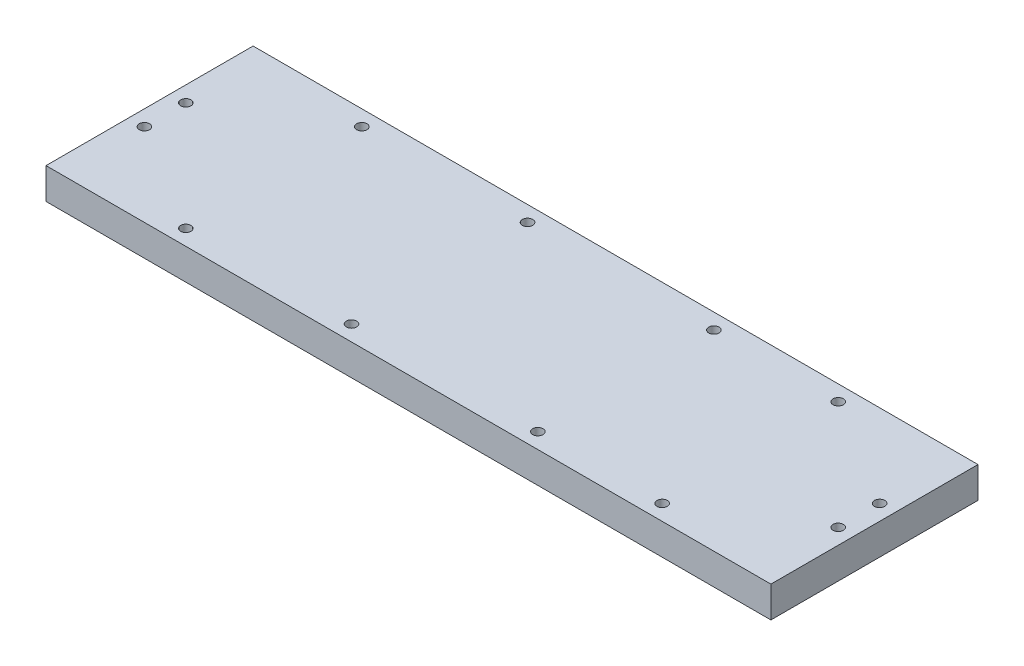
ISO-10303-21;
HEADER;
FILE_DESCRIPTION(('STEP AP214'),'2;1');
FILE_NAME('part.step','',(''),(''),'','','');
FILE_SCHEMA(('AUTOMOTIVE_DESIGN { 1 0 10303 214 1 1 1 1 }'));
ENDSEC;
DATA;
#1=APPLICATION_CONTEXT('core data for automotive mechanical design processes');
#2=APPLICATION_PROTOCOL_DEFINITION('international standard','automotive_design',2000,#1);
#3=PRODUCT_CONTEXT('',#1,'mechanical');
#4=PRODUCT('Part','Part','',(#3));
#5=PRODUCT_RELATED_PRODUCT_CATEGORY('part','',(#4));
#6=PRODUCT_DEFINITION_FORMATION('','',#4);
#7=PRODUCT_DEFINITION_CONTEXT('part definition',#1,'design');
#8=PRODUCT_DEFINITION('design','',#6,#7);
#9=PRODUCT_DEFINITION_SHAPE('','',#8);
#10=(LENGTH_UNIT() NAMED_UNIT(*) SI_UNIT(.MILLI.,.METRE.));
#11=(NAMED_UNIT(*) PLANE_ANGLE_UNIT() SI_UNIT($,.RADIAN.));
#12=(NAMED_UNIT(*) SI_UNIT($,.STERADIAN.) SOLID_ANGLE_UNIT());
#13=UNCERTAINTY_MEASURE_WITH_UNIT(LENGTH_MEASURE(1.E-05),#10,'distance_accuracy_value','');
#14=(GEOMETRIC_REPRESENTATION_CONTEXT(3) GLOBAL_UNCERTAINTY_ASSIGNED_CONTEXT((#13)) GLOBAL_UNIT_ASSIGNED_CONTEXT((#10,
#11,#12)) REPRESENTATION_CONTEXT('',''));
#15=CARTESIAN_POINT('',(0.,0.,0.));
#16=DIRECTION('',(0.,0.,1.));
#17=DIRECTION('',(1.,0.,0.));
#18=AXIS2_PLACEMENT_3D('',#15,#16,#17);
#19=CARTESIAN_POINT('',(222.25,19.05,-63.5));
#20=DIRECTION('',(-1.,0.,0.));
#21=DIRECTION('',(0.,0.,1.));
#22=AXIS2_PLACEMENT_3D('',#19,#20,#21);
#23=PLANE('',#22);
#24=DIRECTION('',(0.,0.,-1.));
#25=VECTOR('',#24,1.);
#26=CARTESIAN_POINT('',(222.25,0.,-63.5));
#27=LINE('',#26,#25);
#28=CARTESIAN_POINT('',(222.25,0.,63.5));
#29=VERTEX_POINT('',#28);
#30=CARTESIAN_POINT('',(222.25,0.,-63.5));
#31=VERTEX_POINT('',#30);
#32=EDGE_CURVE('E109',#29,#31,#27,.T.);
#33=ORIENTED_EDGE('',*,*,#32,.T.);
#34=DIRECTION('',(0.,-1.,0.));
#35=VECTOR('',#34,1.);
#36=CARTESIAN_POINT('',(222.25,19.05,-63.5));
#37=LINE('',#36,#35);
#38=CARTESIAN_POINT('',(222.25,19.05,-63.5));
#39=VERTEX_POINT('',#38);
#40=EDGE_CURVE('E11',#39,#31,#37,.T.);
#41=ORIENTED_EDGE('',*,*,#40,.F.);
#42=DIRECTION('',(0.,0.,-1.));
#43=VECTOR('',#42,1.);
#44=CARTESIAN_POINT('',(222.25,19.05,-63.5));
#45=LINE('',#44,#43);
#46=CARTESIAN_POINT('',(222.25,19.05,63.5));
#47=VERTEX_POINT('',#46);
#48=EDGE_CURVE('E92',#47,#39,#45,.T.);
#49=ORIENTED_EDGE('',*,*,#48,.F.);
#50=DIRECTION('',(0.,-1.,0.));
#51=VECTOR('',#50,1.);
#52=CARTESIAN_POINT('',(222.25,19.05,63.5));
#53=LINE('',#52,#51);
#54=EDGE_CURVE('E105',#47,#29,#53,.T.);
#55=ORIENTED_EDGE('',*,*,#54,.T.);
#56=EDGE_LOOP('',(#33,#41,#49,#55));
#57=FACE_BOUND('',#56,.T.);
#58=ADVANCED_FACE('F40',(#57),#23,.F.);
#59=CARTESIAN_POINT('',(-222.25,19.05,-63.5));
#60=DIRECTION('',(0.,0.,1.));
#61=DIRECTION('',(1.,0.,0.));
#62=AXIS2_PLACEMENT_3D('',#59,#60,#61);
#63=PLANE('',#62);
#64=DIRECTION('',(-1.,0.,0.));
#65=VECTOR('',#64,1.);
#66=CARTESIAN_POINT('',(-222.25,0.,-63.5));
#67=LINE('',#66,#65);
#68=CARTESIAN_POINT('',(-222.25,0.,-63.5));
#69=VERTEX_POINT('',#68);
#70=EDGE_CURVE('E97',#31,#69,#67,.T.);
#71=ORIENTED_EDGE('',*,*,#70,.T.);
#72=DIRECTION('',(0.,-1.,0.));
#73=VECTOR('',#72,1.);
#74=CARTESIAN_POINT('',(-222.25,19.05,-63.5));
#75=LINE('',#74,#73);
#76=CARTESIAN_POINT('',(-222.25,19.05,-63.5));
#77=VERTEX_POINT('',#76);
#78=EDGE_CURVE('E49',#77,#69,#75,.T.);
#79=ORIENTED_EDGE('',*,*,#78,.F.);
#80=DIRECTION('',(-1.,0.,0.));
#81=VECTOR('',#80,1.);
#82=CARTESIAN_POINT('',(-222.25,19.05,-63.5));
#83=LINE('',#82,#81);
#84=EDGE_CURVE('E87',#39,#77,#83,.T.);
#85=ORIENTED_EDGE('',*,*,#84,.F.);
#86=ORIENTED_EDGE('',*,*,#40,.T.);
#87=EDGE_LOOP('',(#71,#79,#85,#86));
#88=FACE_BOUND('',#87,.T.);
#89=ADVANCED_FACE('F96',(#88),#63,.F.);
#90=CARTESIAN_POINT('',(-222.25,19.05,-63.5));
#91=DIRECTION('',(1.,0.,0.));
#92=DIRECTION('',(0.,0.,-1.));
#93=AXIS2_PLACEMENT_3D('',#90,#91,#92);
#94=PLANE('',#93);
#95=DIRECTION('',(0.,0.,1.));
#96=VECTOR('',#95,1.);
#97=CARTESIAN_POINT('',(-222.25,0.,-63.5));
#98=LINE('',#97,#96);
#99=CARTESIAN_POINT('',(-222.25,0.,63.5));
#100=VERTEX_POINT('',#99);
#101=EDGE_CURVE('E74',#69,#100,#98,.T.);
#102=ORIENTED_EDGE('',*,*,#101,.T.);
#103=DIRECTION('',(0.,-1.,0.));
#104=VECTOR('',#103,1.);
#105=CARTESIAN_POINT('',(-222.25,19.05,63.5));
#106=LINE('',#105,#104);
#107=CARTESIAN_POINT('',(-222.25,19.05,63.5));
#108=VERTEX_POINT('',#107);
#109=EDGE_CURVE('E99',#108,#100,#106,.T.);
#110=ORIENTED_EDGE('',*,*,#109,.F.);
#111=DIRECTION('',(0.,0.,1.));
#112=VECTOR('',#111,1.);
#113=CARTESIAN_POINT('',(-222.25,19.05,-63.5));
#114=LINE('',#113,#112);
#115=EDGE_CURVE('E90',#77,#108,#114,.T.);
#116=ORIENTED_EDGE('',*,*,#115,.F.);
#117=ORIENTED_EDGE('',*,*,#78,.T.);
#118=EDGE_LOOP('',(#102,#110,#116,#117));
#119=FACE_BOUND('',#118,.T.);
#120=ADVANCED_FACE('F100',(#119),#94,.F.);
#121=CARTESIAN_POINT('',(-222.25,19.05,63.5));
#122=DIRECTION('',(0.,0.,-1.));
#123=DIRECTION('',(-1.,0.,0.));
#124=AXIS2_PLACEMENT_3D('',#121,#122,#123);
#125=PLANE('',#124);
#126=DIRECTION('',(1.,0.,0.));
#127=VECTOR('',#126,1.);
#128=CARTESIAN_POINT('',(-222.25,0.,63.5));
#129=LINE('',#128,#127);
#130=EDGE_CURVE('E80',#100,#29,#129,.T.);
#131=ORIENTED_EDGE('',*,*,#130,.T.);
#132=ORIENTED_EDGE('',*,*,#54,.F.);
#133=DIRECTION('',(1.,0.,0.));
#134=VECTOR('',#133,1.);
#135=CARTESIAN_POINT('',(-222.25,19.05,63.5));
#136=LINE('',#135,#134);
#137=EDGE_CURVE('E57',#108,#47,#136,.T.);
#138=ORIENTED_EDGE('',*,*,#137,.F.);
#139=ORIENTED_EDGE('',*,*,#109,.T.);
#140=EDGE_LOOP('',(#131,#132,#138,#139));
#141=FACE_BOUND('',#140,.T.);
#142=ADVANCED_FACE('F124',(#141),#125,.F.);
#143=CARTESIAN_POINT('',(0.,19.05,0.));
#144=DIRECTION('',(0.,1.,0.));
#145=DIRECTION('',(0.,0.,1.));
#146=AXIS2_PLACEMENT_3D('',#143,#144,#145);
#147=PLANE('',#146);
#148=CARTESIAN_POINT('',(212.725,19.05,-12.7));
#149=DIRECTION('',(0.,-1.,0.));
#150=DIRECTION('',(0.,0.,1.));
#151=AXIS2_PLACEMENT_3D('',#148,#149,#150);
#152=CIRCLE('',#151,3.175);
#153=CARTESIAN_POINT('',(212.725,19.05,-9.525));
#154=VERTEX_POINT('',#153);
#155=EDGE_CURVE('E221',#154,#154,#152,.T.);
#156=ORIENTED_EDGE('',*,*,#155,.T.);
#157=EDGE_LOOP('',(#156));
#158=FACE_BOUND('',#157,.T.);
#159=CARTESIAN_POINT('',(212.725,19.05,12.7));
#160=DIRECTION('',(0.,-1.,0.));
#161=DIRECTION('',(0.,0.,1.));
#162=AXIS2_PLACEMENT_3D('',#159,#160,#161);
#163=CIRCLE('',#162,3.175);
#164=CARTESIAN_POINT('',(212.725,19.05,15.875));
#165=VERTEX_POINT('',#164);
#166=EDGE_CURVE('E212',#165,#165,#163,.T.);
#167=ORIENTED_EDGE('',*,*,#166,.T.);
#168=EDGE_LOOP('',(#167));
#169=FACE_BOUND('',#168,.T.);
#170=CARTESIAN_POINT('',(-212.725,19.05,-12.7));
#171=DIRECTION('',(0.,1.,0.));
#172=DIRECTION('',(0.,0.,1.));
#173=AXIS2_PLACEMENT_3D('',#170,#171,#172);
#174=CIRCLE('',#173,3.175);
#175=CARTESIAN_POINT('',(-212.725,19.05,-9.525));
#176=VERTEX_POINT('',#175);
#177=EDGE_CURVE('E205',#176,#176,#174,.T.);
#178=ORIENTED_EDGE('',*,*,#177,.F.);
#179=EDGE_LOOP('',(#178));
#180=FACE_BOUND('',#179,.T.);
#181=CARTESIAN_POINT('',(-212.725,19.05,12.7));
#182=DIRECTION('',(0.,1.,0.));
#183=DIRECTION('',(0.,0.,1.));
#184=AXIS2_PLACEMENT_3D('',#181,#182,#183);
#185=CIRCLE('',#184,3.175);
#186=CARTESIAN_POINT('',(-212.725,19.05,15.875));
#187=VERTEX_POINT('',#186);
#188=EDGE_CURVE('E196',#187,#187,#185,.T.);
#189=ORIENTED_EDGE('',*,*,#188,.F.);
#190=EDGE_LOOP('',(#189));
#191=FACE_BOUND('',#190,.T.);
#192=CARTESIAN_POINT('',(-146.05,19.05,-53.975));
#193=DIRECTION('',(0.,-1.,0.));
#194=DIRECTION('',(0.,0.,-1.));
#195=AXIS2_PLACEMENT_3D('',#192,#193,#194);
#196=CIRCLE('',#195,3.175);
#197=CARTESIAN_POINT('',(-146.05,19.05,-57.15));
#198=VERTEX_POINT('',#197);
#199=EDGE_CURVE('E189',#198,#198,#196,.T.);
#200=ORIENTED_EDGE('',*,*,#199,.T.);
#201=EDGE_LOOP('',(#200));
#202=FACE_BOUND('',#201,.T.);
#203=CARTESIAN_POINT('',(-44.4500000000001,19.05,-53.975));
#204=DIRECTION('',(0.,-1.,0.));
#205=DIRECTION('',(0.,0.,-1.));
#206=AXIS2_PLACEMENT_3D('',#203,#204,#205);
#207=CIRCLE('',#206,3.175);
#208=CARTESIAN_POINT('',(-44.4500000000001,19.05,-57.15));
#209=VERTEX_POINT('',#208);
#210=EDGE_CURVE('E181',#209,#209,#207,.T.);
#211=ORIENTED_EDGE('',*,*,#210,.T.);
#212=EDGE_LOOP('',(#211));
#213=FACE_BOUND('',#212,.T.);
#214=CARTESIAN_POINT('',(69.8499999999999,19.05,-53.975));
#215=DIRECTION('',(0.,-1.,0.));
#216=DIRECTION('',(0.,0.,-1.));
#217=AXIS2_PLACEMENT_3D('',#214,#215,#216);
#218=CIRCLE('',#217,3.175);
#219=CARTESIAN_POINT('',(69.8499999999999,19.05,-57.15));
#220=VERTEX_POINT('',#219);
#221=EDGE_CURVE('E173',#220,#220,#218,.T.);
#222=ORIENTED_EDGE('',*,*,#221,.T.);
#223=EDGE_LOOP('',(#222));
#224=FACE_BOUND('',#223,.T.);
#225=CARTESIAN_POINT('',(146.05,19.05,-53.975));
#226=DIRECTION('',(0.,-1.,0.));
#227=DIRECTION('',(0.,0.,-1.));
#228=AXIS2_PLACEMENT_3D('',#225,#226,#227);
#229=CIRCLE('',#228,3.175);
#230=CARTESIAN_POINT('',(146.05,19.05,-57.15));
#231=VERTEX_POINT('',#230);
#232=EDGE_CURVE('E164',#231,#231,#229,.T.);
#233=ORIENTED_EDGE('',*,*,#232,.T.);
#234=EDGE_LOOP('',(#233));
#235=FACE_BOUND('',#234,.T.);
#236=CARTESIAN_POINT('',(-146.05,19.05,53.975));
#237=DIRECTION('',(0.,1.,0.));
#238=DIRECTION('',(0.,0.,1.));
#239=AXIS2_PLACEMENT_3D('',#236,#237,#238);
#240=CIRCLE('',#239,3.175);
#241=CARTESIAN_POINT('',(-146.05,19.05,57.15));
#242=VERTEX_POINT('',#241);
#243=EDGE_CURVE('E157',#242,#242,#240,.T.);
#244=ORIENTED_EDGE('',*,*,#243,.F.);
#245=EDGE_LOOP('',(#244));
#246=FACE_BOUND('',#245,.T.);
#247=CARTESIAN_POINT('',(-44.4500000000001,19.05,53.975));
#248=DIRECTION('',(0.,1.,0.));
#249=DIRECTION('',(0.,0.,1.));
#250=AXIS2_PLACEMENT_3D('',#247,#248,#249);
#251=CIRCLE('',#250,3.175);
#252=CARTESIAN_POINT('',(-44.4500000000001,19.05,57.15));
#253=VERTEX_POINT('',#252);
#254=EDGE_CURVE('E149',#253,#253,#251,.T.);
#255=ORIENTED_EDGE('',*,*,#254,.F.);
#256=EDGE_LOOP('',(#255));
#257=FACE_BOUND('',#256,.T.);
#258=CARTESIAN_POINT('',(69.8499999999999,19.05,53.975));
#259=DIRECTION('',(0.,1.,0.));
#260=DIRECTION('',(0.,0.,1.));
#261=AXIS2_PLACEMENT_3D('',#258,#259,#260);
#262=CIRCLE('',#261,3.175);
#263=CARTESIAN_POINT('',(69.8499999999999,19.05,57.15));
#264=VERTEX_POINT('',#263);
#265=EDGE_CURVE('E141',#264,#264,#262,.T.);
#266=ORIENTED_EDGE('',*,*,#265,.F.);
#267=EDGE_LOOP('',(#266));
#268=FACE_BOUND('',#267,.T.);
#269=CARTESIAN_POINT('',(146.05,19.05,53.975));
#270=DIRECTION('',(0.,1.,0.));
#271=DIRECTION('',(0.,0.,1.));
#272=AXIS2_PLACEMENT_3D('',#269,#270,#271);
#273=CIRCLE('',#272,3.175);
#274=CARTESIAN_POINT('',(146.05,19.05,57.15));
#275=VERTEX_POINT('',#274);
#276=EDGE_CURVE('E132',#275,#275,#273,.T.);
#277=ORIENTED_EDGE('',*,*,#276,.F.);
#278=EDGE_LOOP('',(#277));
#279=FACE_BOUND('',#278,.T.);
#280=ORIENTED_EDGE('',*,*,#48,.T.);
#281=ORIENTED_EDGE('',*,*,#84,.T.);
#282=ORIENTED_EDGE('',*,*,#115,.T.);
#283=ORIENTED_EDGE('',*,*,#137,.T.);
#284=EDGE_LOOP('',(#280,#281,#282,#283));
#285=FACE_BOUND('',#284,.T.);
#286=ADVANCED_FACE('F88',(#158,#169,#180,#191,#202,#213,#224,#235,#246,#257,#268,#279,#285),
#147,.T.);
#287=CARTESIAN_POINT('',(0.,0.,0.));
#288=DIRECTION('',(0.,1.,0.));
#289=DIRECTION('',(0.,0.,1.));
#290=AXIS2_PLACEMENT_3D('',#287,#288,#289);
#291=PLANE('',#290);
#292=CARTESIAN_POINT('',(-95.2500000000001,0.,31.75));
#293=DIRECTION('',(0.,1.,0.));
#294=DIRECTION('',(0.,0.,1.));
#295=AXIS2_PLACEMENT_3D('',#292,#293,#294);
#296=CIRCLE('',#295,1.5875);
#297=CARTESIAN_POINT('',(-95.2500000000001,0.,33.3375));
#298=VERTEX_POINT('',#297);
#299=EDGE_CURVE('E268',#298,#298,#296,.T.);
#300=ORIENTED_EDGE('',*,*,#299,.T.);
#301=EDGE_LOOP('',(#300));
#302=FACE_BOUND('',#301,.T.);
#303=CARTESIAN_POINT('',(0.,0.,31.75));
#304=DIRECTION('',(0.,1.,0.));
#305=DIRECTION('',(0.,0.,1.));
#306=AXIS2_PLACEMENT_3D('',#303,#304,#305);
#307=CIRCLE('',#306,1.5875);
#308=CARTESIAN_POINT('',(0.,0.,33.3375));
#309=VERTEX_POINT('',#308);
#310=EDGE_CURVE('E260',#309,#309,#307,.T.);
#311=ORIENTED_EDGE('',*,*,#310,.T.);
#312=EDGE_LOOP('',(#311));
#313=FACE_BOUND('',#312,.T.);
#314=CARTESIAN_POINT('',(95.2499999999999,0.,31.75));
#315=DIRECTION('',(0.,1.,0.));
#316=DIRECTION('',(0.,0.,1.));
#317=AXIS2_PLACEMENT_3D('',#314,#315,#316);
#318=CIRCLE('',#317,1.5875);
#319=CARTESIAN_POINT('',(95.2499999999999,0.,33.3375));
#320=VERTEX_POINT('',#319);
#321=EDGE_CURVE('E252',#320,#320,#318,.T.);
#322=ORIENTED_EDGE('',*,*,#321,.T.);
#323=EDGE_LOOP('',(#322));
#324=FACE_BOUND('',#323,.T.);
#325=CARTESIAN_POINT('',(-95.2500000000001,0.,-31.75));
#326=DIRECTION('',(0.,-1.,0.));
#327=DIRECTION('',(0.,0.,-1.));
#328=AXIS2_PLACEMENT_3D('',#325,#326,#327);
#329=CIRCLE('',#328,1.5875);
#330=CARTESIAN_POINT('',(-95.2500000000001,0.,-33.3375));
#331=VERTEX_POINT('',#330);
#332=EDGE_CURVE('E245',#331,#331,#329,.T.);
#333=ORIENTED_EDGE('',*,*,#332,.F.);
#334=EDGE_LOOP('',(#333));
#335=FACE_BOUND('',#334,.T.);
#336=CARTESIAN_POINT('',(0.,0.,-31.75));
#337=DIRECTION('',(0.,-1.,0.));
#338=DIRECTION('',(0.,0.,-1.));
#339=AXIS2_PLACEMENT_3D('',#336,#337,#338);
#340=CIRCLE('',#339,1.5875);
#341=CARTESIAN_POINT('',(0.,0.,-33.3375));
#342=VERTEX_POINT('',#341);
#343=EDGE_CURVE('E237',#342,#342,#340,.T.);
#344=ORIENTED_EDGE('',*,*,#343,.F.);
#345=EDGE_LOOP('',(#344));
#346=FACE_BOUND('',#345,.T.);
#347=CARTESIAN_POINT('',(95.2499999999999,0.,-31.75));
#348=DIRECTION('',(0.,-1.,0.));
#349=DIRECTION('',(0.,0.,-1.));
#350=AXIS2_PLACEMENT_3D('',#347,#348,#349);
#351=CIRCLE('',#350,1.5875);
#352=CARTESIAN_POINT('',(95.2499999999999,0.,-33.3375));
#353=VERTEX_POINT('',#352);
#354=EDGE_CURVE('E228',#353,#353,#351,.T.);
#355=ORIENTED_EDGE('',*,*,#354,.F.);
#356=EDGE_LOOP('',(#355));
#357=FACE_BOUND('',#356,.T.);
#358=ORIENTED_EDGE('',*,*,#32,.F.);
#359=ORIENTED_EDGE('',*,*,#130,.F.);
#360=ORIENTED_EDGE('',*,*,#101,.F.);
#361=ORIENTED_EDGE('',*,*,#70,.F.);
#362=EDGE_LOOP('',(#358,#359,#360,#361));
#363=FACE_BOUND('',#362,.T.);
#364=ADVANCED_FACE('F127',(#302,#313,#324,#335,#346,#357,#363),#291,.F.);
#365=CARTESIAN_POINT('',(146.05,6.35,53.975));
#366=DIRECTION('',(0.,1.,0.));
#367=DIRECTION('',(0.,0.,1.));
#368=AXIS2_PLACEMENT_3D('',#365,#366,#367);
#369=CYLINDRICAL_SURFACE('',#368,3.175);
#370=CARTESIAN_POINT('',(146.05,6.35,53.975));
#371=DIRECTION('',(0.,1.,0.));
#372=DIRECTION('',(0.,0.,1.));
#373=AXIS2_PLACEMENT_3D('',#370,#371,#372);
#374=CIRCLE('',#373,3.175);
#375=CARTESIAN_POINT('',(146.05,6.35,57.15));
#376=VERTEX_POINT('',#375);
#377=EDGE_CURVE('E136',#376,#376,#374,.T.);
#378=ORIENTED_EDGE('',*,*,#377,.F.);
#379=EDGE_LOOP('',(#378));
#380=FACE_BOUND('',#379,.T.);
#381=ORIENTED_EDGE('',*,*,#276,.T.);
#382=EDGE_LOOP('',(#381));
#383=FACE_BOUND('',#382,.T.);
#384=ADVANCED_FACE('F301',(#380,#383),#369,.F.);
#385=CARTESIAN_POINT('',(146.05,6.35,53.975));
#386=DIRECTION('',(0.,1.,0.));
#387=DIRECTION('',(0.,0.,1.));
#388=AXIS2_PLACEMENT_3D('',#385,#386,#387);
#389=PLANE('',#388);
#390=ORIENTED_EDGE('',*,*,#377,.T.);
#391=EDGE_LOOP('',(#390));
#392=FACE_BOUND('',#391,.T.);
#393=ADVANCED_FACE('F308',(#392),#389,.T.);
#394=CARTESIAN_POINT('',(69.8499999999999,6.35,53.975));
#395=DIRECTION('',(0.,1.,0.));
#396=DIRECTION('',(0.,0.,1.));
#397=AXIS2_PLACEMENT_3D('',#394,#395,#396);
#398=CYLINDRICAL_SURFACE('',#397,3.175);
#399=CARTESIAN_POINT('',(69.8499999999999,6.35,53.975));
#400=DIRECTION('',(0.,1.,0.));
#401=DIRECTION('',(0.,0.,1.));
#402=AXIS2_PLACEMENT_3D('',#399,#400,#401);
#403=CIRCLE('',#402,3.175);
#404=CARTESIAN_POINT('',(69.8499999999999,6.35,57.15));
#405=VERTEX_POINT('',#404);
#406=EDGE_CURVE('E145',#405,#405,#403,.T.);
#407=ORIENTED_EDGE('',*,*,#406,.F.);
#408=EDGE_LOOP('',(#407));
#409=FACE_BOUND('',#408,.T.);
#410=ORIENTED_EDGE('',*,*,#265,.T.);
#411=EDGE_LOOP('',(#410));
#412=FACE_BOUND('',#411,.T.);
#413=ADVANCED_FACE('F312',(#409,#412),#398,.F.);
#414=CARTESIAN_POINT('',(69.8499999999999,6.35,53.975));
#415=DIRECTION('',(0.,1.,0.));
#416=DIRECTION('',(0.,0.,1.));
#417=AXIS2_PLACEMENT_3D('',#414,#415,#416);
#418=PLANE('',#417);
#419=ORIENTED_EDGE('',*,*,#406,.T.);
#420=EDGE_LOOP('',(#419));
#421=FACE_BOUND('',#420,.T.);
#422=ADVANCED_FACE('F316',(#421),#418,.T.);
#423=CARTESIAN_POINT('',(-44.4500000000001,6.35,53.975));
#424=DIRECTION('',(0.,1.,0.));
#425=DIRECTION('',(0.,0.,1.));
#426=AXIS2_PLACEMENT_3D('',#423,#424,#425);
#427=CYLINDRICAL_SURFACE('',#426,3.175);
#428=CARTESIAN_POINT('',(-44.4500000000001,6.35,53.975));
#429=DIRECTION('',(0.,1.,0.));
#430=DIRECTION('',(0.,0.,1.));
#431=AXIS2_PLACEMENT_3D('',#428,#429,#430);
#432=CIRCLE('',#431,3.175);
#433=CARTESIAN_POINT('',(-44.4500000000001,6.35,57.15));
#434=VERTEX_POINT('',#433);
#435=EDGE_CURVE('E153',#434,#434,#432,.T.);
#436=ORIENTED_EDGE('',*,*,#435,.F.);
#437=EDGE_LOOP('',(#436));
#438=FACE_BOUND('',#437,.T.);
#439=ORIENTED_EDGE('',*,*,#254,.T.);
#440=EDGE_LOOP('',(#439));
#441=FACE_BOUND('',#440,.T.);
#442=ADVANCED_FACE('F320',(#438,#441),#427,.F.);
#443=CARTESIAN_POINT('',(-44.4500000000001,6.35,53.975));
#444=DIRECTION('',(0.,1.,0.));
#445=DIRECTION('',(0.,0.,1.));
#446=AXIS2_PLACEMENT_3D('',#443,#444,#445);
#447=PLANE('',#446);
#448=ORIENTED_EDGE('',*,*,#435,.T.);
#449=EDGE_LOOP('',(#448));
#450=FACE_BOUND('',#449,.T.);
#451=ADVANCED_FACE('F324',(#450),#447,.T.);
#452=CARTESIAN_POINT('',(-146.05,6.35,53.975));
#453=DIRECTION('',(0.,1.,0.));
#454=DIRECTION('',(0.,0.,1.));
#455=AXIS2_PLACEMENT_3D('',#452,#453,#454);
#456=CYLINDRICAL_SURFACE('',#455,3.175);
#457=CARTESIAN_POINT('',(-146.05,6.35,53.975));
#458=DIRECTION('',(0.,1.,0.));
#459=DIRECTION('',(0.,0.,1.));
#460=AXIS2_PLACEMENT_3D('',#457,#458,#459);
#461=CIRCLE('',#460,3.175);
#462=CARTESIAN_POINT('',(-146.05,6.35,57.15));
#463=VERTEX_POINT('',#462);
#464=EDGE_CURVE('E113',#463,#463,#461,.T.);
#465=ORIENTED_EDGE('',*,*,#464,.F.);
#466=EDGE_LOOP('',(#465));
#467=FACE_BOUND('',#466,.T.);
#468=ORIENTED_EDGE('',*,*,#243,.T.);
#469=EDGE_LOOP('',(#468));
#470=FACE_BOUND('',#469,.T.);
#471=ADVANCED_FACE('F328',(#467,#470),#456,.F.);
#472=CARTESIAN_POINT('',(-146.05,6.35,53.975));
#473=DIRECTION('',(0.,1.,0.));
#474=DIRECTION('',(0.,0.,1.));
#475=AXIS2_PLACEMENT_3D('',#472,#473,#474);
#476=PLANE('',#475);
#477=ORIENTED_EDGE('',*,*,#464,.T.);
#478=EDGE_LOOP('',(#477));
#479=FACE_BOUND('',#478,.T.);
#480=ADVANCED_FACE('F332',(#479),#476,.T.);
#481=CARTESIAN_POINT('',(146.05,6.35,-53.975));
#482=DIRECTION('',(0.,1.,0.));
#483=DIRECTION('',(0.,0.,1.));
#484=AXIS2_PLACEMENT_3D('',#481,#482,#483);
#485=CYLINDRICAL_SURFACE('',#484,3.175);
#486=CARTESIAN_POINT('',(146.05,6.35,-53.975));
#487=DIRECTION('',(0.,-1.,0.));
#488=DIRECTION('',(0.,0.,-1.));
#489=AXIS2_PLACEMENT_3D('',#486,#487,#488);
#490=CIRCLE('',#489,3.175);
#491=CARTESIAN_POINT('',(146.05,6.35,-57.15));
#492=VERTEX_POINT('',#491);
#493=EDGE_CURVE('E168',#492,#492,#490,.T.);
#494=ORIENTED_EDGE('',*,*,#493,.T.);
#495=EDGE_LOOP('',(#494));
#496=FACE_BOUND('',#495,.T.);
#497=ORIENTED_EDGE('',*,*,#232,.F.);
#498=EDGE_LOOP('',(#497));
#499=FACE_BOUND('',#498,.T.);
#500=ADVANCED_FACE('F336',(#496,#499),#485,.F.);
#501=CARTESIAN_POINT('',(146.05,6.35,-53.975));
#502=DIRECTION('',(0.,1.,0.));
#503=DIRECTION('',(0.,0.,-1.));
#504=AXIS2_PLACEMENT_3D('',#501,#502,#503);
#505=PLANE('',#504);
#506=ORIENTED_EDGE('',*,*,#493,.F.);
#507=EDGE_LOOP('',(#506));
#508=FACE_BOUND('',#507,.T.);
#509=ADVANCED_FACE('F340',(#508),#505,.T.);
#510=CARTESIAN_POINT('',(69.8499999999999,6.35,-53.975));
#511=DIRECTION('',(0.,1.,0.));
#512=DIRECTION('',(0.,0.,1.));
#513=AXIS2_PLACEMENT_3D('',#510,#511,#512);
#514=CYLINDRICAL_SURFACE('',#513,3.175);
#515=CARTESIAN_POINT('',(69.8499999999999,6.35,-53.975));
#516=DIRECTION('',(0.,-1.,0.));
#517=DIRECTION('',(0.,0.,-1.));
#518=AXIS2_PLACEMENT_3D('',#515,#516,#517);
#519=CIRCLE('',#518,3.175);
#520=CARTESIAN_POINT('',(69.8499999999999,6.35,-57.15));
#521=VERTEX_POINT('',#520);
#522=EDGE_CURVE('E177',#521,#521,#519,.T.);
#523=ORIENTED_EDGE('',*,*,#522,.T.);
#524=EDGE_LOOP('',(#523));
#525=FACE_BOUND('',#524,.T.);
#526=ORIENTED_EDGE('',*,*,#221,.F.);
#527=EDGE_LOOP('',(#526));
#528=FACE_BOUND('',#527,.T.);
#529=ADVANCED_FACE('F344',(#525,#528),#514,.F.);
#530=CARTESIAN_POINT('',(69.8499999999999,6.35,-53.975));
#531=DIRECTION('',(0.,1.,0.));
#532=DIRECTION('',(0.,0.,-1.));
#533=AXIS2_PLACEMENT_3D('',#530,#531,#532);
#534=PLANE('',#533);
#535=ORIENTED_EDGE('',*,*,#522,.F.);
#536=EDGE_LOOP('',(#535));
#537=FACE_BOUND('',#536,.T.);
#538=ADVANCED_FACE('F348',(#537),#534,.T.);
#539=CARTESIAN_POINT('',(-44.4500000000001,6.35,-53.975));
#540=DIRECTION('',(0.,1.,0.));
#541=DIRECTION('',(0.,0.,1.));
#542=AXIS2_PLACEMENT_3D('',#539,#540,#541);
#543=CYLINDRICAL_SURFACE('',#542,3.175);
#544=CARTESIAN_POINT('',(-44.4500000000001,6.35,-53.975));
#545=DIRECTION('',(0.,-1.,0.));
#546=DIRECTION('',(0.,0.,-1.));
#547=AXIS2_PLACEMENT_3D('',#544,#545,#546);
#548=CIRCLE('',#547,3.175);
#549=CARTESIAN_POINT('',(-44.4500000000001,6.35,-57.15));
#550=VERTEX_POINT('',#549);
#551=EDGE_CURVE('E185',#550,#550,#548,.T.);
#552=ORIENTED_EDGE('',*,*,#551,.T.);
#553=EDGE_LOOP('',(#552));
#554=FACE_BOUND('',#553,.T.);
#555=ORIENTED_EDGE('',*,*,#210,.F.);
#556=EDGE_LOOP('',(#555));
#557=FACE_BOUND('',#556,.T.);
#558=ADVANCED_FACE('F352',(#554,#557),#543,.F.);
#559=CARTESIAN_POINT('',(-44.4500000000001,6.35,-53.975));
#560=DIRECTION('',(0.,1.,0.));
#561=DIRECTION('',(0.,0.,-1.));
#562=AXIS2_PLACEMENT_3D('',#559,#560,#561);
#563=PLANE('',#562);
#564=ORIENTED_EDGE('',*,*,#551,.F.);
#565=EDGE_LOOP('',(#564));
#566=FACE_BOUND('',#565,.T.);
#567=ADVANCED_FACE('F356',(#566),#563,.T.);
#568=CARTESIAN_POINT('',(-146.05,6.35,-53.975));
#569=DIRECTION('',(0.,1.,0.));
#570=DIRECTION('',(0.,0.,1.));
#571=AXIS2_PLACEMENT_3D('',#568,#569,#570);
#572=CYLINDRICAL_SURFACE('',#571,3.175);
#573=CARTESIAN_POINT('',(-146.05,6.35,-53.975));
#574=DIRECTION('',(0.,-1.,0.));
#575=DIRECTION('',(0.,0.,-1.));
#576=AXIS2_PLACEMENT_3D('',#573,#574,#575);
#577=CIRCLE('',#576,3.175);
#578=CARTESIAN_POINT('',(-146.05,6.35,-57.15));
#579=VERTEX_POINT('',#578);
#580=EDGE_CURVE('E137',#579,#579,#577,.T.);
#581=ORIENTED_EDGE('',*,*,#580,.T.);
#582=EDGE_LOOP('',(#581));
#583=FACE_BOUND('',#582,.T.);
#584=ORIENTED_EDGE('',*,*,#199,.F.);
#585=EDGE_LOOP('',(#584));
#586=FACE_BOUND('',#585,.T.);
#587=ADVANCED_FACE('F360',(#583,#586),#572,.F.);
#588=CARTESIAN_POINT('',(-146.05,6.35,-53.975));
#589=DIRECTION('',(0.,1.,0.));
#590=DIRECTION('',(0.,0.,-1.));
#591=AXIS2_PLACEMENT_3D('',#588,#589,#590);
#592=PLANE('',#591);
#593=ORIENTED_EDGE('',*,*,#580,.F.);
#594=EDGE_LOOP('',(#593));
#595=FACE_BOUND('',#594,.T.);
#596=ADVANCED_FACE('F364',(#595),#592,.T.);
#597=CARTESIAN_POINT('',(-212.725,6.35,12.7));
#598=DIRECTION('',(0.,1.,0.));
#599=DIRECTION('',(0.,0.,1.));
#600=AXIS2_PLACEMENT_3D('',#597,#598,#599);
#601=CYLINDRICAL_SURFACE('',#600,3.175);
#602=CARTESIAN_POINT('',(-212.725,6.35,12.7));
#603=DIRECTION('',(0.,1.,0.));
#604=DIRECTION('',(0.,0.,1.));
#605=AXIS2_PLACEMENT_3D('',#602,#603,#604);
#606=CIRCLE('',#605,3.175);
#607=CARTESIAN_POINT('',(-212.725,6.35,15.875));
#608=VERTEX_POINT('',#607);
#609=EDGE_CURVE('E200',#608,#608,#606,.T.);
#610=ORIENTED_EDGE('',*,*,#609,.F.);
#611=EDGE_LOOP('',(#610));
#612=FACE_BOUND('',#611,.T.);
#613=ORIENTED_EDGE('',*,*,#188,.T.);
#614=EDGE_LOOP('',(#613));
#615=FACE_BOUND('',#614,.T.);
#616=ADVANCED_FACE('F368',(#612,#615),#601,.F.);
#617=CARTESIAN_POINT('',(-212.725,6.35,12.7));
#618=DIRECTION('',(0.,1.,0.));
#619=DIRECTION('',(0.,0.,1.));
#620=AXIS2_PLACEMENT_3D('',#617,#618,#619);
#621=PLANE('',#620);
#622=ORIENTED_EDGE('',*,*,#609,.T.);
#623=EDGE_LOOP('',(#622));
#624=FACE_BOUND('',#623,.T.);
#625=ADVANCED_FACE('F372',(#624),#621,.T.);
#626=CARTESIAN_POINT('',(-212.725,6.35,-12.7));
#627=DIRECTION('',(0.,1.,0.));
#628=DIRECTION('',(0.,0.,1.));
#629=AXIS2_PLACEMENT_3D('',#626,#627,#628);
#630=CYLINDRICAL_SURFACE('',#629,3.175);
#631=CARTESIAN_POINT('',(-212.725,6.35,-12.7));
#632=DIRECTION('',(0.,1.,0.));
#633=DIRECTION('',(0.,0.,1.));
#634=AXIS2_PLACEMENT_3D('',#631,#632,#633);
#635=CIRCLE('',#634,3.175);
#636=CARTESIAN_POINT('',(-212.725,6.35,-9.525));
#637=VERTEX_POINT('',#636);
#638=EDGE_CURVE('E169',#637,#637,#635,.T.);
#639=ORIENTED_EDGE('',*,*,#638,.F.);
#640=EDGE_LOOP('',(#639));
#641=FACE_BOUND('',#640,.T.);
#642=ORIENTED_EDGE('',*,*,#177,.T.);
#643=EDGE_LOOP('',(#642));
#644=FACE_BOUND('',#643,.T.);
#645=ADVANCED_FACE('F376',(#641,#644),#630,.F.);
#646=CARTESIAN_POINT('',(-212.725,6.35,-12.7));
#647=DIRECTION('',(0.,1.,0.));
#648=DIRECTION('',(0.,0.,1.));
#649=AXIS2_PLACEMENT_3D('',#646,#647,#648);
#650=PLANE('',#649);
#651=ORIENTED_EDGE('',*,*,#638,.T.);
#652=EDGE_LOOP('',(#651));
#653=FACE_BOUND('',#652,.T.);
#654=ADVANCED_FACE('F380',(#653),#650,.T.);
#655=CARTESIAN_POINT('',(212.725,6.35,12.7));
#656=DIRECTION('',(0.,1.,0.));
#657=DIRECTION('',(0.,0.,1.));
#658=AXIS2_PLACEMENT_3D('',#655,#656,#657);
#659=CYLINDRICAL_SURFACE('',#658,3.175);
#660=CARTESIAN_POINT('',(212.725,6.35,12.7));
#661=DIRECTION('',(0.,-1.,0.));
#662=DIRECTION('',(0.,0.,1.));
#663=AXIS2_PLACEMENT_3D('',#660,#661,#662);
#664=CIRCLE('',#663,3.175);
#665=CARTESIAN_POINT('',(212.725,6.35,15.875));
#666=VERTEX_POINT('',#665);
#667=EDGE_CURVE('E216',#666,#666,#664,.T.);
#668=ORIENTED_EDGE('',*,*,#667,.T.);
#669=EDGE_LOOP('',(#668));
#670=FACE_BOUND('',#669,.T.);
#671=ORIENTED_EDGE('',*,*,#166,.F.);
#672=EDGE_LOOP('',(#671));
#673=FACE_BOUND('',#672,.T.);
#674=ADVANCED_FACE('F384',(#670,#673),#659,.F.);
#675=CARTESIAN_POINT('',(212.725,6.35,12.7));
#676=DIRECTION('',(0.,1.,0.));
#677=DIRECTION('',(0.,0.,1.));
#678=AXIS2_PLACEMENT_3D('',#675,#676,#677);
#679=PLANE('',#678);
#680=ORIENTED_EDGE('',*,*,#667,.F.);
#681=EDGE_LOOP('',(#680));
#682=FACE_BOUND('',#681,.T.);
#683=ADVANCED_FACE('F388',(#682),#679,.T.);
#684=CARTESIAN_POINT('',(212.725,6.35,-12.7));
#685=DIRECTION('',(0.,1.,0.));
#686=DIRECTION('',(0.,0.,1.));
#687=AXIS2_PLACEMENT_3D('',#684,#685,#686);
#688=CYLINDRICAL_SURFACE('',#687,3.175);
#689=CARTESIAN_POINT('',(212.725,6.35,-12.7));
#690=DIRECTION('',(0.,-1.,0.));
#691=DIRECTION('',(0.,0.,1.));
#692=AXIS2_PLACEMENT_3D('',#689,#690,#691);
#693=CIRCLE('',#692,3.175);
#694=CARTESIAN_POINT('',(212.725,6.35,-9.525));
#695=VERTEX_POINT('',#694);
#696=EDGE_CURVE('E201',#695,#695,#693,.T.);
#697=ORIENTED_EDGE('',*,*,#696,.T.);
#698=EDGE_LOOP('',(#697));
#699=FACE_BOUND('',#698,.T.);
#700=ORIENTED_EDGE('',*,*,#155,.F.);
#701=EDGE_LOOP('',(#700));
#702=FACE_BOUND('',#701,.T.);
#703=ADVANCED_FACE('F392',(#699,#702),#688,.F.);
#704=CARTESIAN_POINT('',(212.725,6.35,-12.7));
#705=DIRECTION('',(0.,1.,0.));
#706=DIRECTION('',(0.,0.,1.));
#707=AXIS2_PLACEMENT_3D('',#704,#705,#706);
#708=PLANE('',#707);
#709=ORIENTED_EDGE('',*,*,#696,.F.);
#710=EDGE_LOOP('',(#709));
#711=FACE_BOUND('',#710,.T.);
#712=ADVANCED_FACE('F396',(#711),#708,.T.);
#713=CARTESIAN_POINT('',(95.2499999999999,6.35,-31.75));
#714=DIRECTION('',(0.,-1.,0.));
#715=DIRECTION('',(0.,0.,-1.));
#716=AXIS2_PLACEMENT_3D('',#713,#714,#715);
#717=CYLINDRICAL_SURFACE('',#716,1.5875);
#718=CARTESIAN_POINT('',(95.2499999999999,6.35,-31.75));
#719=DIRECTION('',(0.,-1.,0.));
#720=DIRECTION('',(0.,0.,-1.));
#721=AXIS2_PLACEMENT_3D('',#718,#719,#720);
#722=CIRCLE('',#721,1.5875);
#723=CARTESIAN_POINT('',(95.2499999999999,6.35,-33.3375));
#724=VERTEX_POINT('',#723);
#725=EDGE_CURVE('E232',#724,#724,#722,.T.);
#726=ORIENTED_EDGE('',*,*,#725,.F.);
#727=EDGE_LOOP('',(#726));
#728=FACE_BOUND('',#727,.T.);
#729=ORIENTED_EDGE('',*,*,#354,.T.);
#730=EDGE_LOOP('',(#729));
#731=FACE_BOUND('',#730,.T.);
#732=ADVANCED_FACE('F400',(#728,#731),#717,.F.);
#733=CARTESIAN_POINT('',(95.2499999999999,6.35,-31.75));
#734=DIRECTION('',(0.,-1.,0.));
#735=DIRECTION('',(0.,0.,-1.));
#736=AXIS2_PLACEMENT_3D('',#733,#734,#735);
#737=PLANE('',#736);
#738=ORIENTED_EDGE('',*,*,#725,.T.);
#739=EDGE_LOOP('',(#738));
#740=FACE_BOUND('',#739,.T.);
#741=ADVANCED_FACE('F404',(#740),#737,.T.);
#742=CARTESIAN_POINT('',(0.,6.35,-31.75));
#743=DIRECTION('',(0.,-1.,0.));
#744=DIRECTION('',(0.,0.,-1.));
#745=AXIS2_PLACEMENT_3D('',#742,#743,#744);
#746=CYLINDRICAL_SURFACE('',#745,1.5875);
#747=CARTESIAN_POINT('',(0.,6.35,-31.75));
#748=DIRECTION('',(0.,-1.,0.));
#749=DIRECTION('',(0.,0.,-1.));
#750=AXIS2_PLACEMENT_3D('',#747,#748,#749);
#751=CIRCLE('',#750,1.5875);
#752=CARTESIAN_POINT('',(0.,6.35,-33.3375));
#753=VERTEX_POINT('',#752);
#754=EDGE_CURVE('E241',#753,#753,#751,.T.);
#755=ORIENTED_EDGE('',*,*,#754,.F.);
#756=EDGE_LOOP('',(#755));
#757=FACE_BOUND('',#756,.T.);
#758=ORIENTED_EDGE('',*,*,#343,.T.);
#759=EDGE_LOOP('',(#758));
#760=FACE_BOUND('',#759,.T.);
#761=ADVANCED_FACE('F408',(#757,#760),#746,.F.);
#762=CARTESIAN_POINT('',(0.,6.35,-31.75));
#763=DIRECTION('',(0.,-1.,0.));
#764=DIRECTION('',(0.,0.,-1.));
#765=AXIS2_PLACEMENT_3D('',#762,#763,#764);
#766=PLANE('',#765);
#767=ORIENTED_EDGE('',*,*,#754,.T.);
#768=EDGE_LOOP('',(#767));
#769=FACE_BOUND('',#768,.T.);
#770=ADVANCED_FACE('F412',(#769),#766,.T.);
#771=CARTESIAN_POINT('',(-95.2500000000001,6.35,-31.75));
#772=DIRECTION('',(0.,-1.,0.));
#773=DIRECTION('',(0.,0.,-1.));
#774=AXIS2_PLACEMENT_3D('',#771,#772,#773);
#775=CYLINDRICAL_SURFACE('',#774,1.5875);
#776=CARTESIAN_POINT('',(-95.2500000000001,6.35,-31.75));
#777=DIRECTION('',(0.,-1.,0.));
#778=DIRECTION('',(0.,0.,-1.));
#779=AXIS2_PLACEMENT_3D('',#776,#777,#778);
#780=CIRCLE('',#779,1.5875);
#781=CARTESIAN_POINT('',(-95.2500000000001,6.35,-33.3375));
#782=VERTEX_POINT('',#781);
#783=EDGE_CURVE('E217',#782,#782,#780,.T.);
#784=ORIENTED_EDGE('',*,*,#783,.F.);
#785=EDGE_LOOP('',(#784));
#786=FACE_BOUND('',#785,.T.);
#787=ORIENTED_EDGE('',*,*,#332,.T.);
#788=EDGE_LOOP('',(#787));
#789=FACE_BOUND('',#788,.T.);
#790=ADVANCED_FACE('F416',(#786,#789),#775,.F.);
#791=CARTESIAN_POINT('',(-95.2500000000001,6.35,-31.75));
#792=DIRECTION('',(0.,-1.,0.));
#793=DIRECTION('',(0.,0.,-1.));
#794=AXIS2_PLACEMENT_3D('',#791,#792,#793);
#795=PLANE('',#794);
#796=ORIENTED_EDGE('',*,*,#783,.T.);
#797=EDGE_LOOP('',(#796));
#798=FACE_BOUND('',#797,.T.);
#799=ADVANCED_FACE('F420',(#798),#795,.T.);
#800=CARTESIAN_POINT('',(95.2499999999999,6.35,31.75));
#801=DIRECTION('',(0.,-1.,0.));
#802=DIRECTION('',(0.,0.,-1.));
#803=AXIS2_PLACEMENT_3D('',#800,#801,#802);
#804=CYLINDRICAL_SURFACE('',#803,1.5875);
#805=CARTESIAN_POINT('',(95.2499999999999,6.35,31.75));
#806=DIRECTION('',(0.,1.,0.));
#807=DIRECTION('',(0.,0.,1.));
#808=AXIS2_PLACEMENT_3D('',#805,#806,#807);
#809=CIRCLE('',#808,1.5875);
#810=CARTESIAN_POINT('',(95.2499999999999,6.35,33.3375));
#811=VERTEX_POINT('',#810);
#812=EDGE_CURVE('E256',#811,#811,#809,.T.);
#813=ORIENTED_EDGE('',*,*,#812,.T.);
#814=EDGE_LOOP('',(#813));
#815=FACE_BOUND('',#814,.T.);
#816=ORIENTED_EDGE('',*,*,#321,.F.);
#817=EDGE_LOOP('',(#816));
#818=FACE_BOUND('',#817,.T.);
#819=ADVANCED_FACE('F424',(#815,#818),#804,.F.);
#820=CARTESIAN_POINT('',(95.2499999999999,6.35,31.75));
#821=DIRECTION('',(0.,-1.,0.));
#822=DIRECTION('',(0.,0.,1.));
#823=AXIS2_PLACEMENT_3D('',#820,#821,#822);
#824=PLANE('',#823);
#825=ORIENTED_EDGE('',*,*,#812,.F.);
#826=EDGE_LOOP('',(#825));
#827=FACE_BOUND('',#826,.T.);
#828=ADVANCED_FACE('F428',(#827),#824,.T.);
#829=CARTESIAN_POINT('',(0.,6.35,31.75));
#830=DIRECTION('',(0.,-1.,0.));
#831=DIRECTION('',(0.,0.,-1.));
#832=AXIS2_PLACEMENT_3D('',#829,#830,#831);
#833=CYLINDRICAL_SURFACE('',#832,1.5875);
#834=CARTESIAN_POINT('',(0.,6.35,31.75));
#835=DIRECTION('',(0.,1.,0.));
#836=DIRECTION('',(0.,0.,1.));
#837=AXIS2_PLACEMENT_3D('',#834,#835,#836);
#838=CIRCLE('',#837,1.5875);
#839=CARTESIAN_POINT('',(0.,6.35,33.3375));
#840=VERTEX_POINT('',#839);
#841=EDGE_CURVE('E264',#840,#840,#838,.T.);
#842=ORIENTED_EDGE('',*,*,#841,.T.);
#843=EDGE_LOOP('',(#842));
#844=FACE_BOUND('',#843,.T.);
#845=ORIENTED_EDGE('',*,*,#310,.F.);
#846=EDGE_LOOP('',(#845));
#847=FACE_BOUND('',#846,.T.);
#848=ADVANCED_FACE('F432',(#844,#847),#833,.F.);
#849=CARTESIAN_POINT('',(0.,6.35,31.75));
#850=DIRECTION('',(0.,-1.,0.));
#851=DIRECTION('',(0.,0.,1.));
#852=AXIS2_PLACEMENT_3D('',#849,#850,#851);
#853=PLANE('',#852);
#854=ORIENTED_EDGE('',*,*,#841,.F.);
#855=EDGE_LOOP('',(#854));
#856=FACE_BOUND('',#855,.T.);
#857=ADVANCED_FACE('F286',(#856),#853,.T.);
#858=CARTESIAN_POINT('',(-95.2500000000001,6.35,31.75));
#859=DIRECTION('',(0.,-1.,0.));
#860=DIRECTION('',(0.,0.,-1.));
#861=AXIS2_PLACEMENT_3D('',#858,#859,#860);
#862=CYLINDRICAL_SURFACE('',#861,1.5875);
#863=CARTESIAN_POINT('',(-95.2500000000001,6.35,31.75));
#864=DIRECTION('',(0.,1.,0.));
#865=DIRECTION('',(0.,0.,1.));
#866=AXIS2_PLACEMENT_3D('',#863,#864,#865);
#867=CIRCLE('',#866,1.5875);
#868=CARTESIAN_POINT('',(-95.2500000000001,6.35,33.3375));
#869=VERTEX_POINT('',#868);
#870=EDGE_CURVE('E233',#869,#869,#867,.T.);
#871=ORIENTED_EDGE('',*,*,#870,.T.);
#872=EDGE_LOOP('',(#871));
#873=FACE_BOUND('',#872,.T.);
#874=ORIENTED_EDGE('',*,*,#299,.F.);
#875=EDGE_LOOP('',(#874));
#876=FACE_BOUND('',#875,.T.);
#877=ADVANCED_FACE('F277',(#873,#876),#862,.F.);
#878=CARTESIAN_POINT('',(-95.2500000000001,6.35,31.75));
#879=DIRECTION('',(0.,-1.,0.));
#880=DIRECTION('',(0.,0.,1.));
#881=AXIS2_PLACEMENT_3D('',#878,#879,#880);
#882=PLANE('',#881);
#883=ORIENTED_EDGE('',*,*,#870,.F.);
#884=EDGE_LOOP('',(#883));
#885=FACE_BOUND('',#884,.T.);
#886=ADVANCED_FACE('F280',(#885),#882,.T.);
#887=CLOSED_SHELL('',(#58,#89,#120,#142,#286,#364,#384,#393,#413,#422,#442,#451,#471,#480,#500,
#509,#529,#538,#558,#567,#587,#596,#616,#625,#645,#654,#674,#683,#703,#712,#732,#741,#761,#770,
#790,#799,#819,#828,#848,#857,#877,#886));
#888=MANIFOLD_SOLID_BREP('B2',#887);
#889=ADVANCED_BREP_SHAPE_REPRESENTATION('',(#18,#888),#14);
#890=SHAPE_DEFINITION_REPRESENTATION(#9,#889);
ENDSEC;
END-ISO-10303-21;
